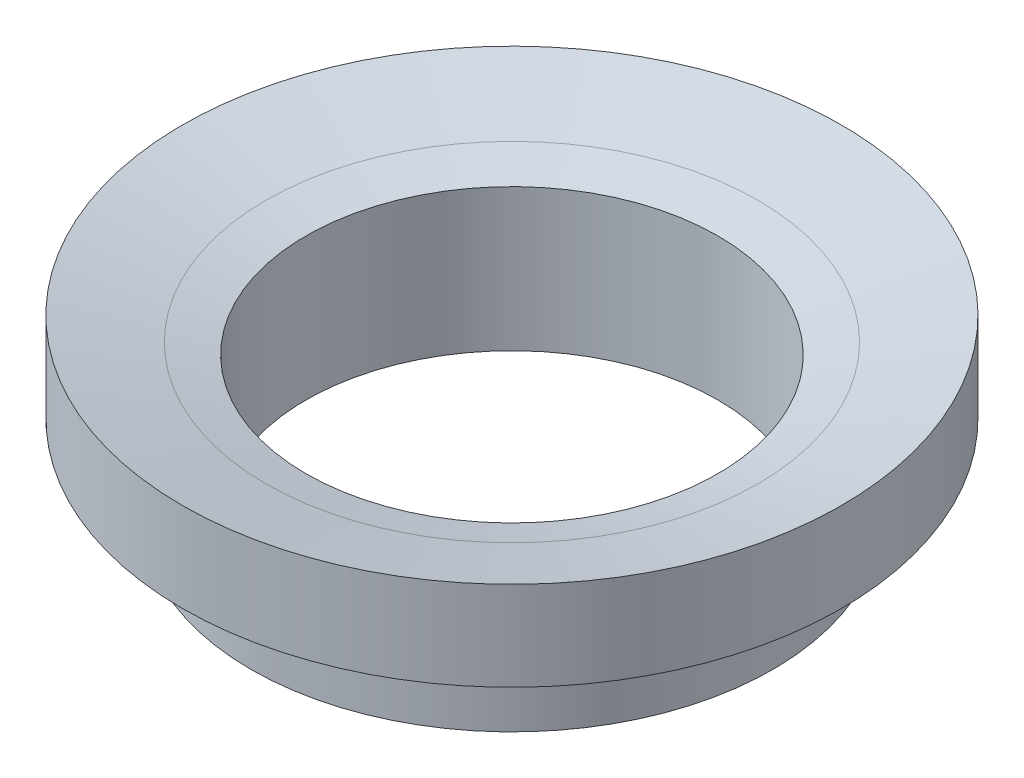
ISO-10303-21;
HEADER;
FILE_DESCRIPTION(('STEP AP214'),'2;1');
FILE_NAME('part.step','',(''),(''),'','','');
FILE_SCHEMA(('AUTOMOTIVE_DESIGN { 1 0 10303 214 1 1 1 1 }'));
ENDSEC;
DATA;
#1=APPLICATION_CONTEXT('core data for automotive mechanical design processes');
#2=APPLICATION_PROTOCOL_DEFINITION('international standard','automotive_design',2000,#1);
#3=PRODUCT_CONTEXT('',#1,'mechanical');
#4=PRODUCT('Part','Part','',(#3));
#5=PRODUCT_RELATED_PRODUCT_CATEGORY('part','',(#4));
#6=PRODUCT_DEFINITION_FORMATION('','',#4);
#7=PRODUCT_DEFINITION_CONTEXT('part definition',#1,'design');
#8=PRODUCT_DEFINITION('design','',#6,#7);
#9=PRODUCT_DEFINITION_SHAPE('','',#8);
#10=(LENGTH_UNIT() NAMED_UNIT(*) SI_UNIT(.MILLI.,.METRE.));
#11=(NAMED_UNIT(*) PLANE_ANGLE_UNIT() SI_UNIT($,.RADIAN.));
#12=(NAMED_UNIT(*) SI_UNIT($,.STERADIAN.) SOLID_ANGLE_UNIT());
#13=UNCERTAINTY_MEASURE_WITH_UNIT(LENGTH_MEASURE(1.E-05),#10,'distance_accuracy_value','');
#14=(GEOMETRIC_REPRESENTATION_CONTEXT(3) GLOBAL_UNCERTAINTY_ASSIGNED_CONTEXT((#13)) GLOBAL_UNIT_ASSIGNED_CONTEXT((#10,
#11,#12)) REPRESENTATION_CONTEXT('',''));
#15=CARTESIAN_POINT('',(0.,0.,0.));
#16=DIRECTION('',(0.,0.,1.));
#17=DIRECTION('',(1.,0.,0.));
#18=AXIS2_PLACEMENT_3D('',#15,#16,#17);
#19=CARTESIAN_POINT('',(0.,0.,0.));
#20=DIRECTION('',(0.,1.,0.));
#21=DIRECTION('',(0.,0.,1.));
#22=AXIS2_PLACEMENT_3D('',#19,#20,#21);
#23=CYLINDRICAL_SURFACE('',#22,15.);
#24=CARTESIAN_POINT('',(0.,-10.35,0.));
#25=DIRECTION('',(0.,1.,0.));
#26=DIRECTION('',(0.,0.,1.));
#27=AXIS2_PLACEMENT_3D('',#24,#25,#26);
#28=CIRCLE('',#27,15.);
#29=CARTESIAN_POINT('',(0.,-10.35,15.));
#30=VERTEX_POINT('',#29);
#31=EDGE_CURVE('E60',#30,#30,#28,.T.);
#32=ORIENTED_EDGE('',*,*,#31,.F.);
#33=EDGE_LOOP('',(#32));
#34=FACE_BOUND('',#33,.T.);
#35=CARTESIAN_POINT('',(0.,0.,0.));
#36=DIRECTION('',(0.,1.,0.));
#37=DIRECTION('',(0.,0.,1.));
#38=AXIS2_PLACEMENT_3D('',#35,#36,#37);
#39=CIRCLE('',#38,15.);
#40=CARTESIAN_POINT('',(0.,0.,15.));
#41=VERTEX_POINT('',#40);
#42=EDGE_CURVE('E10',#41,#41,#39,.T.);
#43=ORIENTED_EDGE('',*,*,#42,.T.);
#44=EDGE_LOOP('',(#43));
#45=FACE_BOUND('',#44,.T.);
#46=ADVANCED_FACE('F35',(#34,#45),#23,.F.);
#47=CARTESIAN_POINT('',(0.,0.,15.));
#48=CARTESIAN_POINT('',(0.,0.00918866813643204,15.0333364665929));
#49=CARTESIAN_POINT('',(0.,0.0275683649343768,15.1000179637581));
#50=CARTESIAN_POINT('',(0.,0.0553407470817471,15.19997951677));
#51=CARTESIAN_POINT('',(0.,0.0828568121450226,15.3000211581037));
#52=CARTESIAN_POINT('',(0.,0.110643842067049,15.3999786610067));
#53=CARTESIAN_POINT('',(0.,0.138155982697952,15.5000213874457));
#54=CARTESIAN_POINT('',(0.,0.165944064255067,15.5999785995718));
#55=CARTESIAN_POINT('',(0.,0.193455923228148,15.7000214038891));
#56=CARTESIAN_POINT('',(0.,0.221244079902053,15.7999785952454));
#57=CARTESIAN_POINT('',(0.,0.248755920097946,15.9000214047546));
#58=CARTESIAN_POINT('',(0.,0.276544076771853,15.9999785961109));
#59=CARTESIAN_POINT('',(0.,0.30405593574493,16.1000214004282));
#60=CARTESIAN_POINT('',(0.,0.331844017302058,16.1999786125543));
#61=CARTESIAN_POINT('',(0.,0.359356157932916,16.3000213389933));
#62=CARTESIAN_POINT('',(0.,0.387143187855101,16.3999788418963));
#63=CARTESIAN_POINT('',(0.,0.414659252917796,16.5000204832301));
#64=CARTESIAN_POINT('',(0.,0.442431635067326,16.5999820362414));
#65=CARTESIAN_POINT('',(0.,0.469999999993648,16.7000000000018));
#66=CARTESIAN_POINT('',(0.,0.497568364958086,16.8000179637516));
#67=CARTESIAN_POINT('',(0.,0.525340746993244,16.8999795167945));
#68=CARTESIAN_POINT('',(0.,0.552856812475263,17.0000211580123));
#69=CARTESIAN_POINT('',(0.,0.580643840834345,17.0999786613476));
#70=CARTESIAN_POINT('',(0.,0.608155987297615,17.2000213861739));
#71=CARTESIAN_POINT('',(0.,0.635944047085708,17.2999786043191));
#72=CARTESIAN_POINT('',(0.,0.663455987293192,17.4000213861751));
#73=CARTESIAN_POINT('',(0.,0.691243840763727,17.4999786613671));
#74=CARTESIAN_POINT('',(0.,0.718756812408908,17.6000211580307));
#75=CARTESIAN_POINT('',(0.,0.746540746004604,17.6999795170678));
#76=CARTESIAN_POINT('',(0.,0.774068364033523,17.8000179640072));
#77=CARTESIAN_POINT('',(0.,0.792555329910585,17.866669801279));
#78=CARTESIAN_POINT('',(0.,0.8018,17.9));
#79=B_SPLINE_CURVE_WITH_KNOTS('',3,(#47,#48,#49,#50,#51,#52,#53,#54,#55,#56,#57,#58,#59,#60,#61,
#62,#63,#64,#65,#66,#67,#68,#69,#70,#71,#72,#73,#74,#75,#76,#77,#78),.UNSPECIFIED.,.F.,.F.,(4,1,
1,1,1,1,1,1,1,1,1,1,1,1,1,1,1,1,1,1,1,1,1,1,1,1,1,1,1,4),(0.,0.034478482654768,
0.0689658226675167,0.103444305322285,0.137931645335033,0.172410127989801,0.20689746800255,
0.241375950657318,0.275863290670067,0.310341773324835,0.344829113337583,0.379307595992351,
0.413794936005099,0.448273418659868,0.482760758672615,0.517239241327385,0.551726581340133,
0.586205063994901,0.62068354664967,0.655170886662417,0.689649369317186,0.724136709329934,
0.758615191984702,0.79310253199745,0.827581014652218,0.862068354664968,0.896546837319736,
0.931034177332484,0.965512659987252,1.),.UNSPECIFIED.);
#80=CARTESIAN_POINT('',(0.,0.,0.));
#81=DIRECTION('',(0.,1.,0.));
#82=AXIS1_PLACEMENT('',#80,#81);
#83=SURFACE_OF_REVOLUTION('',#79,#82);
#84=CARTESIAN_POINT('',(0.,0.8018,0.));
#85=DIRECTION('',(0.,1.,0.));
#86=DIRECTION('',(0.,0.,1.));
#87=AXIS2_PLACEMENT_3D('',#84,#85,#86);
#88=CIRCLE('',#87,17.9);
#89=CARTESIAN_POINT('',(0.,0.8018,17.9));
#90=VERTEX_POINT('',#89);
#91=EDGE_CURVE('E41',#90,#90,#88,.T.);
#92=ORIENTED_EDGE('',*,*,#91,.T.);
#93=EDGE_LOOP('',(#92));
#94=FACE_BOUND('',#93,.T.);
#95=ORIENTED_EDGE('',*,*,#42,.F.);
#96=EDGE_LOOP('',(#95));
#97=FACE_BOUND('',#96,.T.);
#98=ADVANCED_FACE('F69',(#94,#97),#83,.F.);
#99=CARTESIAN_POINT('',(0.,0.8018,0.));
#100=DIRECTION('',(0.,1.,0.));
#101=DIRECTION('',(0.,0.,1.));
#102=AXIS2_PLACEMENT_3D('',#99,#100,#101);
#103=CONICAL_SURFACE('',#102,17.9,1.30023162536113);
#104=CARTESIAN_POINT('',(0.,2.49373373305307,0.));
#105=DIRECTION('',(0.,1.,0.));
#106=DIRECTION('',(0.,0.,1.));
#107=AXIS2_PLACEMENT_3D('',#104,#105,#106);
#108=CIRCLE('',#107,24.);
#109=CARTESIAN_POINT('',(0.,2.49373373305307,24.));
#110=VERTEX_POINT('',#109);
#111=EDGE_CURVE('E45',#110,#110,#108,.T.);
#112=ORIENTED_EDGE('',*,*,#111,.T.);
#113=EDGE_LOOP('',(#112));
#114=FACE_BOUND('',#113,.T.);
#115=ORIENTED_EDGE('',*,*,#91,.F.);
#116=EDGE_LOOP('',(#115));
#117=FACE_BOUND('',#116,.T.);
#118=ADVANCED_FACE('F72',(#114,#117),#103,.F.);
#119=CARTESIAN_POINT('',(0.,0.,0.));
#120=DIRECTION('',(0.,1.,0.));
#121=DIRECTION('',(0.,0.,1.));
#122=AXIS2_PLACEMENT_3D('',#119,#120,#121);
#123=CYLINDRICAL_SURFACE('',#122,24.);
#124=CARTESIAN_POINT('',(0.,-4.,0.));
#125=DIRECTION('',(0.,1.,0.));
#126=DIRECTION('',(0.,0.,1.));
#127=AXIS2_PLACEMENT_3D('',#124,#125,#126);
#128=CIRCLE('',#127,24.);
#129=CARTESIAN_POINT('',(0.,-4.,24.));
#130=VERTEX_POINT('',#129);
#131=EDGE_CURVE('E49',#130,#130,#128,.T.);
#132=ORIENTED_EDGE('',*,*,#131,.T.);
#133=EDGE_LOOP('',(#132));
#134=FACE_BOUND('',#133,.T.);
#135=ORIENTED_EDGE('',*,*,#111,.F.);
#136=EDGE_LOOP('',(#135));
#137=FACE_BOUND('',#136,.T.);
#138=ADVANCED_FACE('F75',(#134,#137),#123,.T.);
#139=CARTESIAN_POINT('',(0.,-4.,0.));
#140=DIRECTION('',(0.,1.,0.));
#141=DIRECTION('',(0.,0.,1.));
#142=AXIS2_PLACEMENT_3D('',#139,#140,#141);
#143=PLANE('',#142);
#144=ORIENTED_EDGE('',*,*,#131,.F.);
#145=EDGE_LOOP('',(#144));
#146=FACE_BOUND('',#145,.T.);
#147=CARTESIAN_POINT('',(0.,-4.,0.));
#148=DIRECTION('',(0.,1.,0.));
#149=DIRECTION('',(0.,0.,1.));
#150=AXIS2_PLACEMENT_3D('',#147,#148,#149);
#151=CIRCLE('',#150,19.);
#152=CARTESIAN_POINT('',(0.,-4.,19.));
#153=VERTEX_POINT('',#152);
#154=EDGE_CURVE('E54',#153,#153,#151,.T.);
#155=ORIENTED_EDGE('',*,*,#154,.T.);
#156=EDGE_LOOP('',(#155));
#157=FACE_BOUND('',#156,.T.);
#158=ADVANCED_FACE('F79',(#146,#157),#143,.F.);
#159=CARTESIAN_POINT('',(0.,0.,0.));
#160=DIRECTION('',(0.,1.,0.));
#161=DIRECTION('',(0.,0.,1.));
#162=AXIS2_PLACEMENT_3D('',#159,#160,#161);
#163=CYLINDRICAL_SURFACE('',#162,19.);
#164=ORIENTED_EDGE('',*,*,#154,.F.);
#165=EDGE_LOOP('',(#164));
#166=FACE_BOUND('',#165,.T.);
#167=CARTESIAN_POINT('',(0.,-10.35,0.));
#168=DIRECTION('',(0.,1.,0.));
#169=DIRECTION('',(0.,0.,1.));
#170=AXIS2_PLACEMENT_3D('',#167,#168,#169);
#171=CIRCLE('',#170,19.);
#172=CARTESIAN_POINT('',(0.,-10.35,19.));
#173=VERTEX_POINT('',#172);
#174=EDGE_CURVE('E57',#173,#173,#171,.T.);
#175=ORIENTED_EDGE('',*,*,#174,.T.);
#176=EDGE_LOOP('',(#175));
#177=FACE_BOUND('',#176,.T.);
#178=ADVANCED_FACE('F83',(#166,#177),#163,.T.);
#179=CARTESIAN_POINT('',(0.,-10.35,0.));
#180=DIRECTION('',(0.,1.,0.));
#181=DIRECTION('',(0.,0.,1.));
#182=AXIS2_PLACEMENT_3D('',#179,#180,#181);
#183=PLANE('',#182);
#184=ORIENTED_EDGE('',*,*,#174,.F.);
#185=EDGE_LOOP('',(#184));
#186=FACE_BOUND('',#185,.T.);
#187=ORIENTED_EDGE('',*,*,#31,.T.);
#188=EDGE_LOOP('',(#187));
#189=FACE_BOUND('',#188,.T.);
#190=ADVANCED_FACE('F87',(#186,#189),#183,.F.);
#191=CLOSED_SHELL('',(#46,#98,#118,#138,#158,#178,#190));
#192=MANIFOLD_SOLID_BREP('B2',#191);
#193=ADVANCED_BREP_SHAPE_REPRESENTATION('',(#18,#192),#14);
#194=SHAPE_DEFINITION_REPRESENTATION(#9,#193);
ENDSEC;
END-ISO-10303-21;
